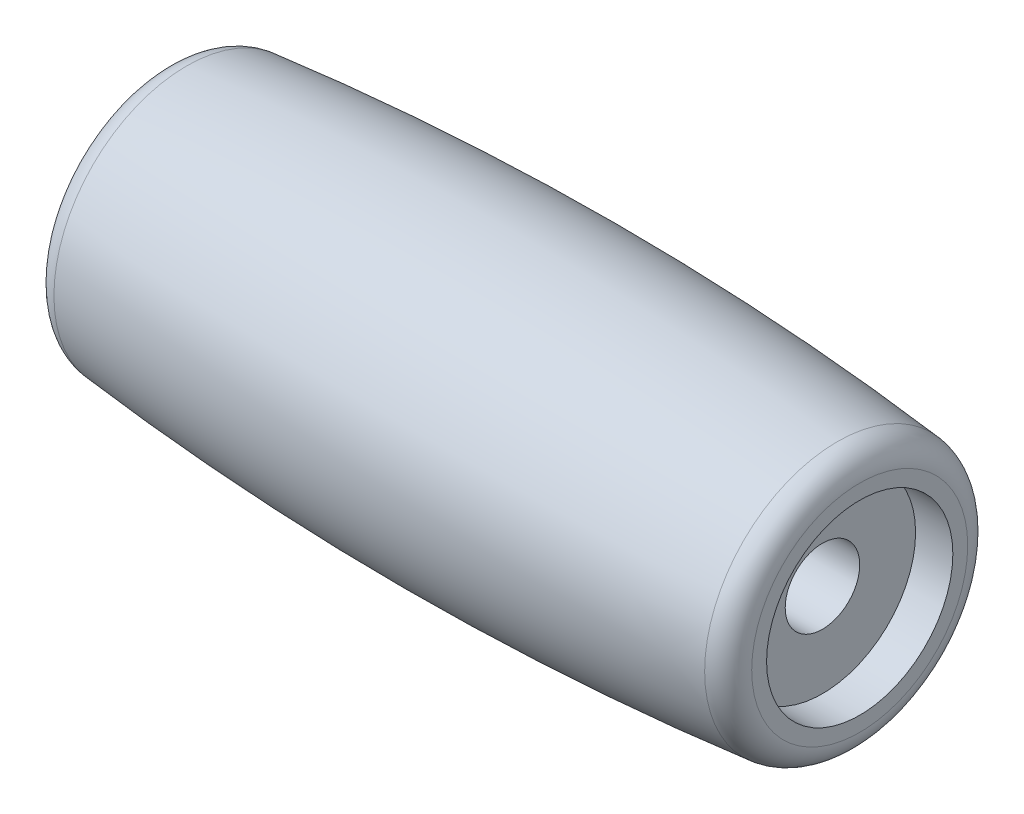
ISO-10303-21;
HEADER;
FILE_DESCRIPTION(('STEP AP214'),'2;1');
FILE_NAME('part.step','',(''),(''),'','','');
FILE_SCHEMA(('AUTOMOTIVE_DESIGN { 1 0 10303 214 1 1 1 1 }'));
ENDSEC;
DATA;
#1=APPLICATION_CONTEXT('core data for automotive mechanical design processes');
#2=APPLICATION_PROTOCOL_DEFINITION('international standard','automotive_design',2000,#1);
#3=PRODUCT_CONTEXT('',#1,'mechanical');
#4=PRODUCT('Part','Part','',(#3));
#5=PRODUCT_RELATED_PRODUCT_CATEGORY('part','',(#4));
#6=PRODUCT_DEFINITION_FORMATION('','',#4);
#7=PRODUCT_DEFINITION_CONTEXT('part definition',#1,'design');
#8=PRODUCT_DEFINITION('design','',#6,#7);
#9=PRODUCT_DEFINITION_SHAPE('','',#8);
#10=(LENGTH_UNIT() NAMED_UNIT(*) SI_UNIT(.MILLI.,.METRE.));
#11=(NAMED_UNIT(*) PLANE_ANGLE_UNIT() SI_UNIT($,.RADIAN.));
#12=(NAMED_UNIT(*) SI_UNIT($,.STERADIAN.) SOLID_ANGLE_UNIT());
#13=UNCERTAINTY_MEASURE_WITH_UNIT(LENGTH_MEASURE(1.E-05),#10,'distance_accuracy_value','');
#14=(GEOMETRIC_REPRESENTATION_CONTEXT(3) GLOBAL_UNCERTAINTY_ASSIGNED_CONTEXT((#13)) GLOBAL_UNIT_ASSIGNED_CONTEXT((#10,
#11,#12)) REPRESENTATION_CONTEXT('',''));
#15=CARTESIAN_POINT('',(0.,0.,0.));
#16=DIRECTION('',(0.,0.,1.));
#17=DIRECTION('',(1.,0.,0.));
#18=AXIS2_PLACEMENT_3D('',#15,#16,#17);
#19=CARTESIAN_POINT('',(20.8375,2.5005,0.));
#20=DIRECTION('',(-1.,0.,0.));
#21=DIRECTION('',(0.,0.,1.));
#22=AXIS2_PLACEMENT_3D('',#19,#20,#21);
#23=PLANE('',#22);
#24=CARTESIAN_POINT('',(20.8375,0.,0.));
#25=DIRECTION('',(-1.,0.,0.));
#26=DIRECTION('',(0.,0.,1.));
#27=AXIS2_PLACEMENT_3D('',#24,#25,#26);
#28=CIRCLE('',#27,6.25125);
#29=CARTESIAN_POINT('',(20.8375,0.,6.25125));
#30=VERTEX_POINT('',#29);
#31=EDGE_CURVE('E10',#30,#30,#28,.T.);
#32=ORIENTED_EDGE('',*,*,#31,.F.);
#33=EDGE_LOOP('',(#32));
#34=FACE_BOUND('',#33,.T.);
#35=CARTESIAN_POINT('',(20.8375,0.,0.));
#36=DIRECTION('',(-1.,0.,0.));
#37=DIRECTION('',(0.,0.,1.));
#38=AXIS2_PLACEMENT_3D('',#35,#36,#37);
#39=CIRCLE('',#38,2.5005);
#40=CARTESIAN_POINT('',(20.8375,0.,2.5005));
#41=VERTEX_POINT('',#40);
#42=EDGE_CURVE('E79',#41,#41,#39,.T.);
#43=ORIENTED_EDGE('',*,*,#42,.T.);
#44=EDGE_LOOP('',(#43));
#45=FACE_BOUND('',#44,.T.);
#46=ADVANCED_FACE('F36',(#34,#45),#23,.F.);
#47=CARTESIAN_POINT('',(-22.7241703148185,0.,0.));
#48=DIRECTION('',(-1.,0.,0.));
#49=DIRECTION('',(0.,0.,1.));
#50=AXIS2_PLACEMENT_3D('',#47,#48,#49);
#51=CYLINDRICAL_SURFACE('',#50,6.25125);
#52=CARTESIAN_POINT('',(23.338,0.,0.));
#53=DIRECTION('',(-1.,0.,0.));
#54=DIRECTION('',(0.,0.,1.));
#55=AXIS2_PLACEMENT_3D('',#52,#53,#54);
#56=CIRCLE('',#55,6.25125);
#57=CARTESIAN_POINT('',(23.338,0.,6.25125));
#58=VERTEX_POINT('',#57);
#59=EDGE_CURVE('E43',#58,#58,#56,.T.);
#60=ORIENTED_EDGE('',*,*,#59,.F.);
#61=EDGE_LOOP('',(#60));
#62=FACE_BOUND('',#61,.T.);
#63=ORIENTED_EDGE('',*,*,#31,.T.);
#64=EDGE_LOOP('',(#63));
#65=FACE_BOUND('',#64,.T.);
#66=ADVANCED_FACE('F129',(#62,#65),#51,.F.);
#67=CARTESIAN_POINT('',(23.338,6.25125,0.));
#68=DIRECTION('',(-1.,0.,0.));
#69=DIRECTION('',(0.,0.,1.));
#70=AXIS2_PLACEMENT_3D('',#67,#68,#69);
#71=PLANE('',#70);
#72=CARTESIAN_POINT('',(23.338,0.,0.));
#73=DIRECTION('',(-1.,0.,0.));
#74=DIRECTION('',(0.,0.,1.));
#75=AXIS2_PLACEMENT_3D('',#72,#73,#74);
#76=CIRCLE('',#75,7.24907730066149);
#77=CARTESIAN_POINT('',(23.338,0.,7.24907730066149));
#78=VERTEX_POINT('',#77);
#79=EDGE_CURVE('E48',#78,#78,#76,.T.);
#80=ORIENTED_EDGE('',*,*,#79,.F.);
#81=EDGE_LOOP('',(#80));
#82=FACE_BOUND('',#81,.T.);
#83=ORIENTED_EDGE('',*,*,#59,.T.);
#84=EDGE_LOOP('',(#83));
#85=FACE_BOUND('',#84,.T.);
#86=ADVANCED_FACE('F124',(#82,#85),#71,.F.);
#87=CARTESIAN_POINT('',(21.671,0.,0.));
#88=DIRECTION('',(-1.,0.,0.));
#89=DIRECTION('',(0.,0.,1.));
#90=AXIS2_PLACEMENT_3D('',#87,#88,#89);
#91=TOROIDAL_SURFACE('',#90,7.24907730066149,1.66700000000002);
#92=CARTESIAN_POINT('',(21.8376465876322,0.,0.));
#93=DIRECTION('',(-1.,0.,0.));
#94=DIRECTION('',(0.,0.,1.));
#95=AXIS2_PLACEMENT_3D('',#92,#93,#94);
#96=CIRCLE('',#95,8.90772672559453);
#97=CARTESIAN_POINT('',(21.8376465876322,0.,8.90772672559453));
#98=VERTEX_POINT('',#97);
#99=EDGE_CURVE('E53',#98,#98,#96,.T.);
#100=ORIENTED_EDGE('',*,*,#99,.F.);
#101=EDGE_LOOP('',(#100));
#102=FACE_BOUND('',#101,.T.);
#103=ORIENTED_EDGE('',*,*,#79,.T.);
#104=EDGE_LOOP('',(#103));
#105=FACE_BOUND('',#104,.T.);
#106=ADVANCED_FACE('F118',(#102,#105),#91,.T.);
#107=CARTESIAN_POINT('',(0.,0.,0.));
#108=DIRECTION('',(-1.,0.,0.));
#109=DIRECTION('',(0.,0.,1.));
#110=AXIS2_PLACEMENT_3D('',#107,#108,#109);
#111=DEGENERATE_TOROIDAL_SURFACE('',#110,208.444458333334,218.446458333334,.F.);
#112=CARTESIAN_POINT('',(-21.8376465876322,0.,0.));
#113=DIRECTION('',(-1.,0.,0.));
#114=DIRECTION('',(0.,0.,1.));
#115=AXIS2_PLACEMENT_3D('',#112,#113,#114);
#116=CIRCLE('',#115,8.90772672559451);
#117=CARTESIAN_POINT('',(-21.8376465876322,0.,8.90772672559451));
#118=VERTEX_POINT('',#117);
#119=EDGE_CURVE('E59',#118,#118,#116,.T.);
#120=ORIENTED_EDGE('',*,*,#119,.F.);
#121=EDGE_LOOP('',(#120));
#122=FACE_BOUND('',#121,.T.);
#123=ORIENTED_EDGE('',*,*,#99,.T.);
#124=EDGE_LOOP('',(#123));
#125=FACE_BOUND('',#124,.T.);
#126=ADVANCED_FACE('F112',(#122,#125),#111,.F.);
#127=CARTESIAN_POINT('',(-21.671,0.,0.));
#128=DIRECTION('',(-1.,0.,0.));
#129=DIRECTION('',(0.,0.,1.));
#130=AXIS2_PLACEMENT_3D('',#127,#128,#129);
#131=TOROIDAL_SURFACE('',#130,7.24907730066149,1.66700000000002);
#132=CARTESIAN_POINT('',(-23.338,0.,0.));
#133=DIRECTION('',(-1.,0.,0.));
#134=DIRECTION('',(0.,0.,1.));
#135=AXIS2_PLACEMENT_3D('',#132,#133,#134);
#136=CIRCLE('',#135,7.24907730066149);
#137=CARTESIAN_POINT('',(-23.338,0.,7.24907730066149));
#138=VERTEX_POINT('',#137);
#139=EDGE_CURVE('E63',#138,#138,#136,.T.);
#140=ORIENTED_EDGE('',*,*,#139,.F.);
#141=EDGE_LOOP('',(#140));
#142=FACE_BOUND('',#141,.T.);
#143=ORIENTED_EDGE('',*,*,#119,.T.);
#144=EDGE_LOOP('',(#143));
#145=FACE_BOUND('',#144,.T.);
#146=ADVANCED_FACE('F106',(#142,#145),#131,.T.);
#147=CARTESIAN_POINT('',(-23.338,6.25125,0.));
#148=DIRECTION('',(1.,0.,0.));
#149=DIRECTION('',(0.,0.,-1.));
#150=AXIS2_PLACEMENT_3D('',#147,#148,#149);
#151=PLANE('',#150);
#152=CARTESIAN_POINT('',(-23.338,0.,0.));
#153=DIRECTION('',(-1.,0.,0.));
#154=DIRECTION('',(0.,0.,1.));
#155=AXIS2_PLACEMENT_3D('',#152,#153,#154);
#156=CIRCLE('',#155,6.25125);
#157=CARTESIAN_POINT('',(-23.338,0.,6.25125));
#158=VERTEX_POINT('',#157);
#159=EDGE_CURVE('E67',#158,#158,#156,.T.);
#160=ORIENTED_EDGE('',*,*,#159,.F.);
#161=EDGE_LOOP('',(#160));
#162=FACE_BOUND('',#161,.T.);
#163=ORIENTED_EDGE('',*,*,#139,.T.);
#164=EDGE_LOOP('',(#163));
#165=FACE_BOUND('',#164,.T.);
#166=ADVANCED_FACE('F100',(#162,#165),#151,.F.);
#167=CARTESIAN_POINT('',(-22.7241703148185,0.,0.));
#168=DIRECTION('',(-1.,0.,0.));
#169=DIRECTION('',(0.,0.,1.));
#170=AXIS2_PLACEMENT_3D('',#167,#168,#169);
#171=CYLINDRICAL_SURFACE('',#170,6.25125);
#172=CARTESIAN_POINT('',(-20.8375,0.,0.));
#173=DIRECTION('',(-1.,0.,0.));
#174=DIRECTION('',(0.,0.,1.));
#175=AXIS2_PLACEMENT_3D('',#172,#173,#174);
#176=CIRCLE('',#175,6.25125);
#177=CARTESIAN_POINT('',(-20.8375,0.,6.25125));
#178=VERTEX_POINT('',#177);
#179=EDGE_CURVE('E71',#178,#178,#176,.T.);
#180=ORIENTED_EDGE('',*,*,#179,.F.);
#181=EDGE_LOOP('',(#180));
#182=FACE_BOUND('',#181,.T.);
#183=ORIENTED_EDGE('',*,*,#159,.T.);
#184=EDGE_LOOP('',(#183));
#185=FACE_BOUND('',#184,.T.);
#186=ADVANCED_FACE('F94',(#182,#185),#171,.F.);
#187=CARTESIAN_POINT('',(-20.8375,2.5005,0.));
#188=DIRECTION('',(1.,0.,0.));
#189=DIRECTION('',(0.,0.,-1.));
#190=AXIS2_PLACEMENT_3D('',#187,#188,#189);
#191=PLANE('',#190);
#192=CARTESIAN_POINT('',(-20.8375,0.,0.));
#193=DIRECTION('',(-1.,0.,0.));
#194=DIRECTION('',(0.,0.,1.));
#195=AXIS2_PLACEMENT_3D('',#192,#193,#194);
#196=CIRCLE('',#195,2.5005);
#197=CARTESIAN_POINT('',(-20.8375,0.,2.5005));
#198=VERTEX_POINT('',#197);
#199=EDGE_CURVE('E75',#198,#198,#196,.T.);
#200=ORIENTED_EDGE('',*,*,#199,.F.);
#201=EDGE_LOOP('',(#200));
#202=FACE_BOUND('',#201,.T.);
#203=ORIENTED_EDGE('',*,*,#179,.T.);
#204=EDGE_LOOP('',(#203));
#205=FACE_BOUND('',#204,.T.);
#206=ADVANCED_FACE('F88',(#202,#205),#191,.F.);
#207=CARTESIAN_POINT('',(-22.7241703148185,0.,0.));
#208=DIRECTION('',(-1.,0.,0.));
#209=DIRECTION('',(0.,0.,1.));
#210=AXIS2_PLACEMENT_3D('',#207,#208,#209);
#211=CYLINDRICAL_SURFACE('',#210,2.5005);
#212=ORIENTED_EDGE('',*,*,#42,.F.);
#213=EDGE_LOOP('',(#212));
#214=FACE_BOUND('',#213,.T.);
#215=ORIENTED_EDGE('',*,*,#199,.T.);
#216=EDGE_LOOP('',(#215));
#217=FACE_BOUND('',#216,.T.);
#218=ADVANCED_FACE('F85',(#214,#217),#211,.F.);
#219=CLOSED_SHELL('',(#46,#66,#86,#106,#126,#146,#166,#186,#206,#218));
#220=MANIFOLD_SOLID_BREP('B2',#219);
#221=ADVANCED_BREP_SHAPE_REPRESENTATION('',(#18,#220),#14);
#222=SHAPE_DEFINITION_REPRESENTATION(#9,#221);
ENDSEC;
END-ISO-10303-21;
